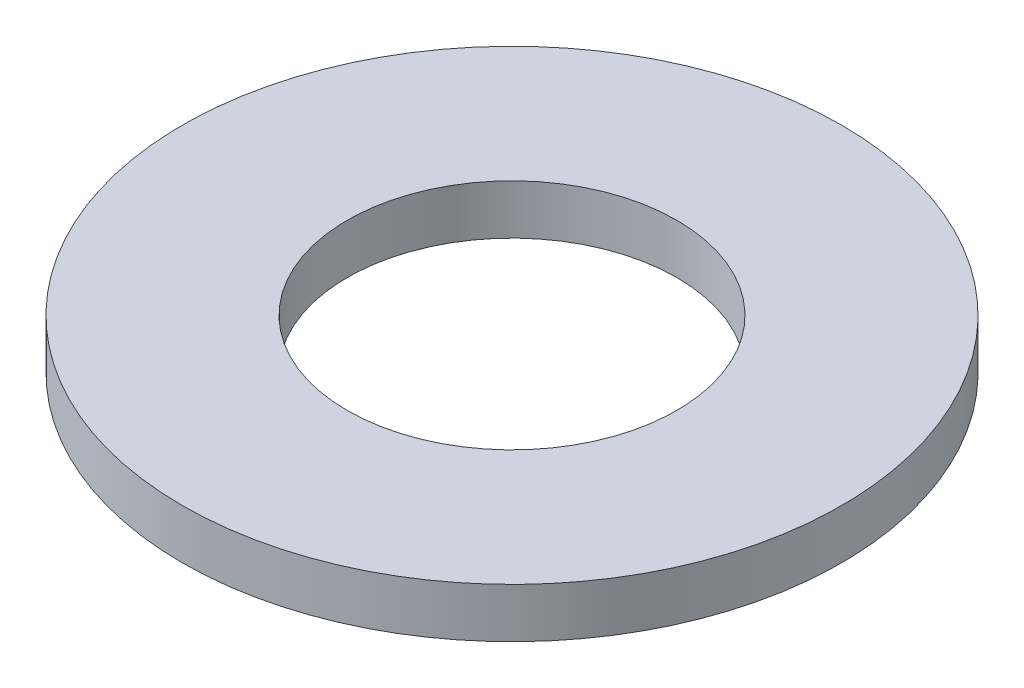
ISO-10303-21;
HEADER;
FILE_DESCRIPTION(('STEP AP214'),'2;1');
FILE_NAME('part.step','',(''),(''),'','','');
FILE_SCHEMA(('AUTOMOTIVE_DESIGN { 1 0 10303 214 1 1 1 1 }'));
ENDSEC;
DATA;
#1=APPLICATION_CONTEXT('core data for automotive mechanical design processes');
#2=APPLICATION_PROTOCOL_DEFINITION('international standard','automotive_design',2000,#1);
#3=PRODUCT_CONTEXT('',#1,'mechanical');
#4=PRODUCT('Part','Part','',(#3));
#5=PRODUCT_RELATED_PRODUCT_CATEGORY('part','',(#4));
#6=PRODUCT_DEFINITION_FORMATION('','',#4);
#7=PRODUCT_DEFINITION_CONTEXT('part definition',#1,'design');
#8=PRODUCT_DEFINITION('design','',#6,#7);
#9=PRODUCT_DEFINITION_SHAPE('','',#8);
#10=(LENGTH_UNIT() NAMED_UNIT(*) SI_UNIT(.MILLI.,.METRE.));
#11=(NAMED_UNIT(*) PLANE_ANGLE_UNIT() SI_UNIT($,.RADIAN.));
#12=(NAMED_UNIT(*) SI_UNIT($,.STERADIAN.) SOLID_ANGLE_UNIT());
#13=UNCERTAINTY_MEASURE_WITH_UNIT(LENGTH_MEASURE(1.E-05),#10,'distance_accuracy_value','');
#14=(GEOMETRIC_REPRESENTATION_CONTEXT(3) GLOBAL_UNCERTAINTY_ASSIGNED_CONTEXT((#13)) GLOBAL_UNIT_ASSIGNED_CONTEXT((#10,
#11,#12)) REPRESENTATION_CONTEXT('',''));
#15=CARTESIAN_POINT('',(0.,0.,0.));
#16=DIRECTION('',(0.,0.,1.));
#17=DIRECTION('',(1.,0.,0.));
#18=AXIS2_PLACEMENT_3D('',#15,#16,#17);
#19=CARTESIAN_POINT('',(0.,2.032,0.));
#20=DIRECTION('',(0.,-1.,0.));
#21=DIRECTION('',(0.,0.,-1.));
#22=AXIS2_PLACEMENT_3D('',#19,#20,#21);
#23=CYLINDRICAL_SURFACE('',#22,13.49375);
#24=CARTESIAN_POINT('',(0.,2.032,0.));
#25=DIRECTION('',(0.,1.,0.));
#26=DIRECTION('',(0.,0.,1.));
#27=AXIS2_PLACEMENT_3D('',#24,#25,#26);
#28=CIRCLE('',#27,13.49375);
#29=CARTESIAN_POINT('',(0.,2.032,13.49375));
#30=VERTEX_POINT('',#29);
#31=EDGE_CURVE('E10',#30,#30,#28,.T.);
#32=ORIENTED_EDGE('',*,*,#31,.F.);
#33=EDGE_LOOP('',(#32));
#34=FACE_BOUND('',#33,.T.);
#35=CARTESIAN_POINT('',(0.,0.,0.));
#36=DIRECTION('',(0.,1.,0.));
#37=DIRECTION('',(0.,0.,1.));
#38=AXIS2_PLACEMENT_3D('',#35,#36,#37);
#39=CIRCLE('',#38,13.49375);
#40=CARTESIAN_POINT('',(0.,0.,13.49375));
#41=VERTEX_POINT('',#40);
#42=EDGE_CURVE('E33',#41,#41,#39,.T.);
#43=ORIENTED_EDGE('',*,*,#42,.T.);
#44=EDGE_LOOP('',(#43));
#45=FACE_BOUND('',#44,.T.);
#46=ADVANCED_FACE('F30',(#34,#45),#23,.T.);
#47=CARTESIAN_POINT('',(0.,2.032,0.));
#48=DIRECTION('',(0.,1.,0.));
#49=DIRECTION('',(0.,0.,1.));
#50=AXIS2_PLACEMENT_3D('',#47,#48,#49);
#51=PLANE('',#50);
#52=CARTESIAN_POINT('',(0.,2.032,0.));
#53=DIRECTION('',(0.,1.,0.));
#54=DIRECTION('',(0.,0.,1.));
#55=AXIS2_PLACEMENT_3D('',#52,#53,#54);
#56=CIRCLE('',#55,6.746875);
#57=CARTESIAN_POINT('',(0.,2.032,6.746875));
#58=VERTEX_POINT('',#57);
#59=EDGE_CURVE('E42',#58,#58,#56,.T.);
#60=ORIENTED_EDGE('',*,*,#59,.F.);
#61=EDGE_LOOP('',(#60));
#62=FACE_BOUND('',#61,.T.);
#63=ORIENTED_EDGE('',*,*,#31,.T.);
#64=EDGE_LOOP('',(#63));
#65=FACE_BOUND('',#64,.T.);
#66=ADVANCED_FACE('F57',(#62,#65),#51,.T.);
#67=CARTESIAN_POINT('',(0.,0.,0.));
#68=DIRECTION('',(0.,1.,0.));
#69=DIRECTION('',(0.,0.,1.));
#70=AXIS2_PLACEMENT_3D('',#67,#68,#69);
#71=PLANE('',#70);
#72=CARTESIAN_POINT('',(0.,0.,0.));
#73=DIRECTION('',(0.,1.,0.));
#74=DIRECTION('',(0.,0.,1.));
#75=AXIS2_PLACEMENT_3D('',#72,#73,#74);
#76=CIRCLE('',#75,6.746875);
#77=CARTESIAN_POINT('',(0.,0.,6.746875));
#78=VERTEX_POINT('',#77);
#79=EDGE_CURVE('E40',#78,#78,#76,.T.);
#80=ORIENTED_EDGE('',*,*,#79,.T.);
#81=EDGE_LOOP('',(#80));
#82=FACE_BOUND('',#81,.T.);
#83=ORIENTED_EDGE('',*,*,#42,.F.);
#84=EDGE_LOOP('',(#83));
#85=FACE_BOUND('',#84,.T.);
#86=ADVANCED_FACE('F48',(#82,#85),#71,.F.);
#87=CARTESIAN_POINT('',(0.,0.,0.));
#88=DIRECTION('',(0.,1.,0.));
#89=DIRECTION('',(0.,0.,1.));
#90=AXIS2_PLACEMENT_3D('',#87,#88,#89);
#91=CYLINDRICAL_SURFACE('',#90,6.746875);
#92=ORIENTED_EDGE('',*,*,#79,.F.);
#93=EDGE_LOOP('',(#92));
#94=FACE_BOUND('',#93,.T.);
#95=ORIENTED_EDGE('',*,*,#59,.T.);
#96=EDGE_LOOP('',(#95));
#97=FACE_BOUND('',#96,.T.);
#98=ADVANCED_FACE('F51',(#94,#97),#91,.F.);
#99=CLOSED_SHELL('',(#46,#66,#86,#98));
#100=MANIFOLD_SOLID_BREP('B2',#99);
#101=ADVANCED_BREP_SHAPE_REPRESENTATION('',(#18,#100),#14);
#102=SHAPE_DEFINITION_REPRESENTATION(#9,#101);
ENDSEC;
END-ISO-10303-21;
